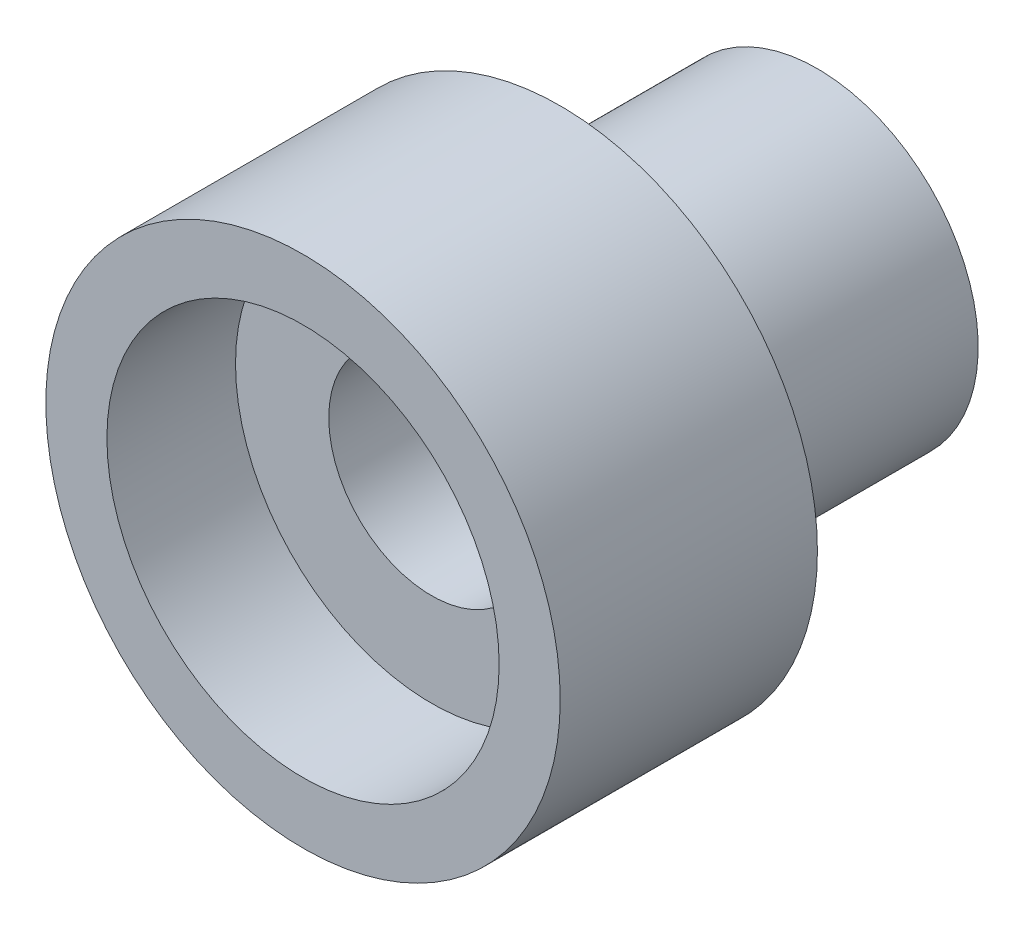
ISO-10303-21;
HEADER;
FILE_DESCRIPTION(('STEP AP214'),'2;1');
FILE_NAME('part.step','',(''),(''),'','','');
FILE_SCHEMA(('AUTOMOTIVE_DESIGN { 1 0 10303 214 1 1 1 1 }'));
ENDSEC;
DATA;
#1=APPLICATION_CONTEXT('core data for automotive mechanical design processes');
#2=APPLICATION_PROTOCOL_DEFINITION('international standard','automotive_design',2000,#1);
#3=PRODUCT_CONTEXT('',#1,'mechanical');
#4=PRODUCT('Part','Part','',(#3));
#5=PRODUCT_RELATED_PRODUCT_CATEGORY('part','',(#4));
#6=PRODUCT_DEFINITION_FORMATION('','',#4);
#7=PRODUCT_DEFINITION_CONTEXT('part definition',#1,'design');
#8=PRODUCT_DEFINITION('design','',#6,#7);
#9=PRODUCT_DEFINITION_SHAPE('','',#8);
#10=(LENGTH_UNIT() NAMED_UNIT(*) SI_UNIT(.MILLI.,.METRE.));
#11=(NAMED_UNIT(*) PLANE_ANGLE_UNIT() SI_UNIT($,.RADIAN.));
#12=(NAMED_UNIT(*) SI_UNIT($,.STERADIAN.) SOLID_ANGLE_UNIT());
#13=UNCERTAINTY_MEASURE_WITH_UNIT(LENGTH_MEASURE(1.E-05),#10,'distance_accuracy_value','');
#14=(GEOMETRIC_REPRESENTATION_CONTEXT(3) GLOBAL_UNCERTAINTY_ASSIGNED_CONTEXT((#13)) GLOBAL_UNIT_ASSIGNED_CONTEXT((#10,
#11,#12)) REPRESENTATION_CONTEXT('',''));
#15=CARTESIAN_POINT('',(0.,0.,0.));
#16=DIRECTION('',(0.,0.,1.));
#17=DIRECTION('',(1.,0.,0.));
#18=AXIS2_PLACEMENT_3D('',#15,#16,#17);
#19=CARTESIAN_POINT('',(0.,0.,-8.5254833995939));
#20=DIRECTION('',(0.,0.,1.));
#21=DIRECTION('',(1.,0.,0.));
#22=AXIS2_PLACEMENT_3D('',#19,#20,#21);
#23=CYLINDRICAL_SURFACE('',#22,1.6);
#24=CARTESIAN_POINT('',(0.,0.,-4.));
#25=DIRECTION('',(0.,0.,-1.));
#26=DIRECTION('',(-1.,0.,0.));
#27=AXIS2_PLACEMENT_3D('',#24,#25,#26);
#28=CIRCLE('',#27,1.6);
#29=CARTESIAN_POINT('',(-1.6,0.,-4.));
#30=VERTEX_POINT('',#29);
#31=EDGE_CURVE('E55',#30,#30,#28,.T.);
#32=ORIENTED_EDGE('',*,*,#31,.T.);
#33=EDGE_LOOP('',(#32));
#34=FACE_BOUND('',#33,.T.);
#35=CARTESIAN_POINT('',(0.,0.,2.));
#36=DIRECTION('',(0.,0.,1.));
#37=DIRECTION('',(1.,0.,0.));
#38=AXIS2_PLACEMENT_3D('',#35,#36,#37);
#39=CIRCLE('',#38,1.6);
#40=CARTESIAN_POINT('',(1.6,0.,2.));
#41=VERTEX_POINT('',#40);
#42=EDGE_CURVE('E37',#41,#41,#39,.T.);
#43=ORIENTED_EDGE('',*,*,#42,.T.);
#44=EDGE_LOOP('',(#43));
#45=FACE_BOUND('',#44,.T.);
#46=ADVANCED_FACE('F33',(#34,#45),#23,.F.);
#47=CARTESIAN_POINT('',(0.,0.,4.));
#48=DIRECTION('',(0.,0.,-1.));
#49=DIRECTION('',(-1.,0.,0.));
#50=AXIS2_PLACEMENT_3D('',#47,#48,#49);
#51=CYLINDRICAL_SURFACE('',#50,4.);
#52=CARTESIAN_POINT('',(0.,0.,4.));
#53=DIRECTION('',(0.,0.,1.));
#54=DIRECTION('',(1.,0.,0.));
#55=AXIS2_PLACEMENT_3D('',#52,#53,#54);
#56=CIRCLE('',#55,4.);
#57=CARTESIAN_POINT('',(4.,0.,4.));
#58=VERTEX_POINT('',#57);
#59=EDGE_CURVE('E41',#58,#58,#56,.T.);
#60=ORIENTED_EDGE('',*,*,#59,.F.);
#61=EDGE_LOOP('',(#60));
#62=FACE_BOUND('',#61,.T.);
#63=CARTESIAN_POINT('',(0.,0.,0.));
#64=DIRECTION('',(0.,0.,1.));
#65=DIRECTION('',(1.,0.,0.));
#66=AXIS2_PLACEMENT_3D('',#63,#64,#65);
#67=CIRCLE('',#66,4.);
#68=CARTESIAN_POINT('',(4.,0.,0.));
#69=VERTEX_POINT('',#68);
#70=EDGE_CURVE('E46',#69,#69,#67,.T.);
#71=ORIENTED_EDGE('',*,*,#70,.T.);
#72=EDGE_LOOP('',(#71));
#73=FACE_BOUND('',#72,.T.);
#74=ADVANCED_FACE('F35',(#62,#73),#51,.T.);
#75=CARTESIAN_POINT('',(0.,0.,4.));
#76=DIRECTION('',(0.,0.,1.));
#77=DIRECTION('',(1.,0.,0.));
#78=AXIS2_PLACEMENT_3D('',#75,#76,#77);
#79=PLANE('',#78);
#80=CARTESIAN_POINT('',(0.,0.,4.));
#81=DIRECTION('',(0.,0.,1.));
#82=DIRECTION('',(1.,0.,0.));
#83=AXIS2_PLACEMENT_3D('',#80,#81,#82);
#84=CIRCLE('',#83,3.05);
#85=CARTESIAN_POINT('',(3.05,0.,4.));
#86=VERTEX_POINT('',#85);
#87=EDGE_CURVE('E64',#86,#86,#84,.T.);
#88=ORIENTED_EDGE('',*,*,#87,.F.);
#89=EDGE_LOOP('',(#88));
#90=FACE_BOUND('',#89,.T.);
#91=ORIENTED_EDGE('',*,*,#59,.T.);
#92=EDGE_LOOP('',(#91));
#93=FACE_BOUND('',#92,.T.);
#94=ADVANCED_FACE('F79',(#90,#93),#79,.T.);
#95=CARTESIAN_POINT('',(0.,0.,0.));
#96=DIRECTION('',(0.,0.,1.));
#97=DIRECTION('',(1.,0.,0.));
#98=AXIS2_PLACEMENT_3D('',#95,#96,#97);
#99=PLANE('',#98);
#100=CARTESIAN_POINT('',(0.,0.,0.));
#101=DIRECTION('',(0.,0.,-1.));
#102=DIRECTION('',(-1.,0.,0.));
#103=AXIS2_PLACEMENT_3D('',#100,#101,#102);
#104=CIRCLE('',#103,2.5);
#105=CARTESIAN_POINT('',(-2.5,0.,0.));
#106=VERTEX_POINT('',#105);
#107=EDGE_CURVE('E10',#106,#106,#104,.T.);
#108=ORIENTED_EDGE('',*,*,#107,.F.);
#109=EDGE_LOOP('',(#108));
#110=FACE_BOUND('',#109,.T.);
#111=ORIENTED_EDGE('',*,*,#70,.F.);
#112=EDGE_LOOP('',(#111));
#113=FACE_BOUND('',#112,.T.);
#114=ADVANCED_FACE('F82',(#110,#113),#99,.F.);
#115=CARTESIAN_POINT('',(0.,0.,-4.));
#116=DIRECTION('',(0.,0.,1.));
#117=DIRECTION('',(1.,0.,0.));
#118=AXIS2_PLACEMENT_3D('',#115,#116,#117);
#119=CYLINDRICAL_SURFACE('',#118,2.5);
#120=CARTESIAN_POINT('',(0.,0.,-4.));
#121=DIRECTION('',(0.,0.,-1.));
#122=DIRECTION('',(-1.,0.,0.));
#123=AXIS2_PLACEMENT_3D('',#120,#121,#122);
#124=CIRCLE('',#123,2.5);
#125=CARTESIAN_POINT('',(-2.5,0.,-4.));
#126=VERTEX_POINT('',#125);
#127=EDGE_CURVE('E49',#126,#126,#124,.T.);
#128=ORIENTED_EDGE('',*,*,#127,.F.);
#129=EDGE_LOOP('',(#128));
#130=FACE_BOUND('',#129,.T.);
#131=ORIENTED_EDGE('',*,*,#107,.T.);
#132=EDGE_LOOP('',(#131));
#133=FACE_BOUND('',#132,.T.);
#134=ADVANCED_FACE('F98',(#130,#133),#119,.T.);
#135=CARTESIAN_POINT('',(0.,0.,-4.));
#136=DIRECTION('',(0.,0.,-1.));
#137=DIRECTION('',(-1.,0.,0.));
#138=AXIS2_PLACEMENT_3D('',#135,#136,#137);
#139=PLANE('',#138);
#140=ORIENTED_EDGE('',*,*,#31,.F.);
#141=EDGE_LOOP('',(#140));
#142=FACE_BOUND('',#141,.T.);
#143=ORIENTED_EDGE('',*,*,#127,.T.);
#144=EDGE_LOOP('',(#143));
#145=FACE_BOUND('',#144,.T.);
#146=ADVANCED_FACE('F75',(#142,#145),#139,.T.);
#147=CARTESIAN_POINT('',(0.,0.,2.));
#148=DIRECTION('',(0.,0.,1.));
#149=DIRECTION('',(1.,0.,0.));
#150=AXIS2_PLACEMENT_3D('',#147,#148,#149);
#151=CYLINDRICAL_SURFACE('',#150,3.05);
#152=CARTESIAN_POINT('',(0.,0.,2.));
#153=DIRECTION('',(0.,0.,1.));
#154=DIRECTION('',(1.,0.,0.));
#155=AXIS2_PLACEMENT_3D('',#152,#153,#154);
#156=CIRCLE('',#155,3.05);
#157=CARTESIAN_POINT('',(3.05,0.,2.));
#158=VERTEX_POINT('',#157);
#159=EDGE_CURVE('E62',#158,#158,#156,.T.);
#160=ORIENTED_EDGE('',*,*,#159,.F.);
#161=EDGE_LOOP('',(#160));
#162=FACE_BOUND('',#161,.T.);
#163=ORIENTED_EDGE('',*,*,#87,.T.);
#164=EDGE_LOOP('',(#163));
#165=FACE_BOUND('',#164,.T.);
#166=ADVANCED_FACE('F72',(#162,#165),#151,.F.);
#167=CARTESIAN_POINT('',(0.,0.,2.));
#168=DIRECTION('',(0.,0.,1.));
#169=DIRECTION('',(1.,0.,0.));
#170=AXIS2_PLACEMENT_3D('',#167,#168,#169);
#171=PLANE('',#170);
#172=ORIENTED_EDGE('',*,*,#42,.F.);
#173=EDGE_LOOP('',(#172));
#174=FACE_BOUND('',#173,.T.);
#175=ORIENTED_EDGE('',*,*,#159,.T.);
#176=EDGE_LOOP('',(#175));
#177=FACE_BOUND('',#176,.T.);
#178=ADVANCED_FACE('F70',(#174,#177),#171,.T.);
#179=CLOSED_SHELL('',(#46,#74,#94,#114,#134,#146,#166,#178));
#180=MANIFOLD_SOLID_BREP('B2',#179);
#181=ADVANCED_BREP_SHAPE_REPRESENTATION('',(#18,#180),#14);
#182=SHAPE_DEFINITION_REPRESENTATION(#9,#181);
ENDSEC;
END-ISO-10303-21;
